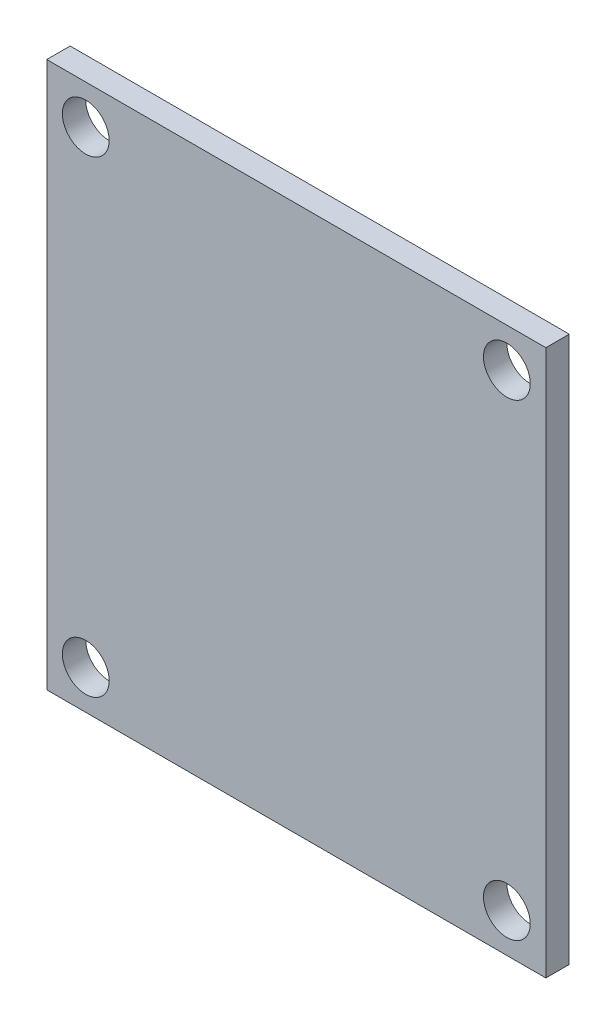
ISO-10303-21;
HEADER;
FILE_DESCRIPTION(('STEP AP214'),'2;1');
FILE_NAME('part.step','',(''),(''),'','','');
FILE_SCHEMA(('AUTOMOTIVE_DESIGN { 1 0 10303 214 1 1 1 1 }'));
ENDSEC;
DATA;
#1=APPLICATION_CONTEXT('core data for automotive mechanical design processes');
#2=APPLICATION_PROTOCOL_DEFINITION('international standard','automotive_design',2000,#1);
#3=PRODUCT_CONTEXT('',#1,'mechanical');
#4=PRODUCT('Part','Part','',(#3));
#5=PRODUCT_RELATED_PRODUCT_CATEGORY('part','',(#4));
#6=PRODUCT_DEFINITION_FORMATION('','',#4);
#7=PRODUCT_DEFINITION_CONTEXT('part definition',#1,'design');
#8=PRODUCT_DEFINITION('design','',#6,#7);
#9=PRODUCT_DEFINITION_SHAPE('','',#8);
#10=(LENGTH_UNIT() NAMED_UNIT(*) SI_UNIT(.MILLI.,.METRE.));
#11=(NAMED_UNIT(*) PLANE_ANGLE_UNIT() SI_UNIT($,.RADIAN.));
#12=(NAMED_UNIT(*) SI_UNIT($,.STERADIAN.) SOLID_ANGLE_UNIT());
#13=UNCERTAINTY_MEASURE_WITH_UNIT(LENGTH_MEASURE(1.E-05),#10,'distance_accuracy_value','');
#14=(GEOMETRIC_REPRESENTATION_CONTEXT(3) GLOBAL_UNCERTAINTY_ASSIGNED_CONTEXT((#13)) GLOBAL_UNIT_ASSIGNED_CONTEXT((#10,
#11,#12)) REPRESENTATION_CONTEXT('',''));
#15=CARTESIAN_POINT('',(0.,0.,0.));
#16=DIRECTION('',(0.,0.,1.));
#17=DIRECTION('',(1.,0.,0.));
#18=AXIS2_PLACEMENT_3D('',#15,#16,#17);
#19=CARTESIAN_POINT('',(0.,0.,1.5));
#20=DIRECTION('',(0.,0.,-1.));
#21=DIRECTION('',(-1.,0.,0.));
#22=AXIS2_PLACEMENT_3D('',#19,#20,#21);
#23=PLANE('',#22);
#24=DIRECTION('',(0.,-1.,0.));
#25=VECTOR('',#24,1.);
#26=CARTESIAN_POINT('',(0.,0.,1.5));
#27=LINE('',#26,#25);
#28=CARTESIAN_POINT('',(0.,35.,1.5));
#29=VERTEX_POINT('',#28);
#30=CARTESIAN_POINT('',(0.,0.,1.5));
#31=VERTEX_POINT('',#30);
#32=EDGE_CURVE('E98',#29,#31,#27,.T.);
#33=ORIENTED_EDGE('',*,*,#32,.T.);
#34=DIRECTION('',(1.,0.,0.));
#35=VECTOR('',#34,1.);
#36=CARTESIAN_POINT('',(0.,0.,1.5));
#37=LINE('',#36,#35);
#38=CARTESIAN_POINT('',(32.,0.,1.5));
#39=VERTEX_POINT('',#38);
#40=EDGE_CURVE('E93',#31,#39,#37,.T.);
#41=ORIENTED_EDGE('',*,*,#40,.T.);
#42=DIRECTION('',(0.,1.,0.));
#43=VECTOR('',#42,1.);
#44=CARTESIAN_POINT('',(32.,0.,1.5));
#45=LINE('',#44,#43);
#46=CARTESIAN_POINT('',(32.,35.,1.5));
#47=VERTEX_POINT('',#46);
#48=EDGE_CURVE('E96',#39,#47,#45,.T.);
#49=ORIENTED_EDGE('',*,*,#48,.T.);
#50=DIRECTION('',(-1.,0.,0.));
#51=VECTOR('',#50,1.);
#52=CARTESIAN_POINT('',(0.,35.,1.5));
#53=LINE('',#52,#51);
#54=EDGE_CURVE('E63',#47,#29,#53,.T.);
#55=ORIENTED_EDGE('',*,*,#54,.T.);
#56=EDGE_LOOP('',(#33,#41,#49,#55));
#57=FACE_BOUND('',#56,.T.);
#58=CARTESIAN_POINT('',(2.5,32.5,1.5));
#59=DIRECTION('',(0.,0.,1.));
#60=DIRECTION('',(1.,0.,0.));
#61=AXIS2_PLACEMENT_3D('',#58,#59,#60);
#62=CIRCLE('',#61,1.5);
#63=CARTESIAN_POINT('',(4.,32.5,1.5));
#64=VERTEX_POINT('',#63);
#65=EDGE_CURVE('E118',#64,#64,#62,.T.);
#66=ORIENTED_EDGE('',*,*,#65,.F.);
#67=EDGE_LOOP('',(#66));
#68=FACE_BOUND('',#67,.T.);
#69=CARTESIAN_POINT('',(29.5,32.5,1.5));
#70=DIRECTION('',(0.,0.,1.));
#71=DIRECTION('',(-1.,0.,0.));
#72=AXIS2_PLACEMENT_3D('',#69,#70,#71);
#73=CIRCLE('',#72,1.5);
#74=CARTESIAN_POINT('',(28.,32.5,1.5));
#75=VERTEX_POINT('',#74);
#76=EDGE_CURVE('E140',#75,#75,#73,.T.);
#77=ORIENTED_EDGE('',*,*,#76,.F.);
#78=EDGE_LOOP('',(#77));
#79=FACE_BOUND('',#78,.T.);
#80=CARTESIAN_POINT('',(29.5,2.5,1.5));
#81=DIRECTION('',(0.,0.,1.));
#82=DIRECTION('',(1.,0.,0.));
#83=AXIS2_PLACEMENT_3D('',#80,#81,#82);
#84=CIRCLE('',#83,1.5);
#85=CARTESIAN_POINT('',(31.,2.5,1.5));
#86=VERTEX_POINT('',#85);
#87=EDGE_CURVE('E148',#86,#86,#84,.T.);
#88=ORIENTED_EDGE('',*,*,#87,.F.);
#89=EDGE_LOOP('',(#88));
#90=FACE_BOUND('',#89,.T.);
#91=CARTESIAN_POINT('',(2.5,2.5,1.5));
#92=DIRECTION('',(0.,0.,1.));
#93=DIRECTION('',(-1.,0.,0.));
#94=AXIS2_PLACEMENT_3D('',#91,#92,#93);
#95=CIRCLE('',#94,1.5);
#96=CARTESIAN_POINT('',(1.,2.5,1.5));
#97=VERTEX_POINT('',#96);
#98=EDGE_CURVE('E156',#97,#97,#95,.T.);
#99=ORIENTED_EDGE('',*,*,#98,.F.);
#100=EDGE_LOOP('',(#99));
#101=FACE_BOUND('',#100,.T.);
#102=ADVANCED_FACE('F45',(#57,#68,#79,#90,#101),#23,.F.);
#103=CARTESIAN_POINT('',(0.,0.,0.));
#104=DIRECTION('',(0.,0.,-1.));
#105=DIRECTION('',(-1.,0.,0.));
#106=AXIS2_PLACEMENT_3D('',#103,#104,#105);
#107=PLANE('',#106);
#108=CARTESIAN_POINT('',(29.5,2.5,0.));
#109=DIRECTION('',(0.,0.,1.));
#110=DIRECTION('',(1.,0.,0.));
#111=AXIS2_PLACEMENT_3D('',#108,#109,#110);
#112=CIRCLE('',#111,1.5);
#113=CARTESIAN_POINT('',(31.,2.5,0.));
#114=VERTEX_POINT('',#113);
#115=EDGE_CURVE('E152',#114,#114,#112,.T.);
#116=ORIENTED_EDGE('',*,*,#115,.T.);
#117=EDGE_LOOP('',(#116));
#118=FACE_BOUND('',#117,.T.);
#119=CARTESIAN_POINT('',(2.5,32.5,0.));
#120=DIRECTION('',(0.,0.,1.));
#121=DIRECTION('',(1.,0.,0.));
#122=AXIS2_PLACEMENT_3D('',#119,#120,#121);
#123=CIRCLE('',#122,1.5);
#124=CARTESIAN_POINT('',(4.,32.5,0.));
#125=VERTEX_POINT('',#124);
#126=EDGE_CURVE('E136',#125,#125,#123,.T.);
#127=ORIENTED_EDGE('',*,*,#126,.T.);
#128=EDGE_LOOP('',(#127));
#129=FACE_BOUND('',#128,.T.);
#130=DIRECTION('',(0.,-1.,0.));
#131=VECTOR('',#130,1.);
#132=CARTESIAN_POINT('',(0.,0.,0.));
#133=LINE('',#132,#131);
#134=CARTESIAN_POINT('',(0.,35.,0.));
#135=VERTEX_POINT('',#134);
#136=CARTESIAN_POINT('',(0.,0.,0.));
#137=VERTEX_POINT('',#136);
#138=EDGE_CURVE('E114',#135,#137,#133,.T.);
#139=ORIENTED_EDGE('',*,*,#138,.F.);
#140=DIRECTION('',(-1.,0.,0.));
#141=VECTOR('',#140,1.);
#142=CARTESIAN_POINT('',(0.,35.,0.));
#143=LINE('',#142,#141);
#144=CARTESIAN_POINT('',(32.,35.,0.));
#145=VERTEX_POINT('',#144);
#146=EDGE_CURVE('E86',#145,#135,#143,.T.);
#147=ORIENTED_EDGE('',*,*,#146,.F.);
#148=DIRECTION('',(0.,1.,0.));
#149=VECTOR('',#148,1.);
#150=CARTESIAN_POINT('',(32.,0.,0.));
#151=LINE('',#150,#149);
#152=CARTESIAN_POINT('',(32.,0.,0.));
#153=VERTEX_POINT('',#152);
#154=EDGE_CURVE('E80',#153,#145,#151,.T.);
#155=ORIENTED_EDGE('',*,*,#154,.F.);
#156=DIRECTION('',(1.,0.,0.));
#157=VECTOR('',#156,1.);
#158=CARTESIAN_POINT('',(0.,0.,0.));
#159=LINE('',#158,#157);
#160=EDGE_CURVE('E103',#137,#153,#159,.T.);
#161=ORIENTED_EDGE('',*,*,#160,.F.);
#162=EDGE_LOOP('',(#139,#147,#155,#161));
#163=FACE_BOUND('',#162,.T.);
#164=CARTESIAN_POINT('',(29.5,32.5,0.));
#165=DIRECTION('',(0.,0.,1.));
#166=DIRECTION('',(-1.,0.,0.));
#167=AXIS2_PLACEMENT_3D('',#164,#165,#166);
#168=CIRCLE('',#167,1.5);
#169=CARTESIAN_POINT('',(28.,32.5,0.));
#170=VERTEX_POINT('',#169);
#171=EDGE_CURVE('E144',#170,#170,#168,.T.);
#172=ORIENTED_EDGE('',*,*,#171,.T.);
#173=EDGE_LOOP('',(#172));
#174=FACE_BOUND('',#173,.T.);
#175=CARTESIAN_POINT('',(2.5,2.5,0.));
#176=DIRECTION('',(0.,0.,1.));
#177=DIRECTION('',(-1.,0.,0.));
#178=AXIS2_PLACEMENT_3D('',#175,#176,#177);
#179=CIRCLE('',#178,1.5);
#180=CARTESIAN_POINT('',(1.,2.5,0.));
#181=VERTEX_POINT('',#180);
#182=EDGE_CURVE('E160',#181,#181,#179,.T.);
#183=ORIENTED_EDGE('',*,*,#182,.T.);
#184=EDGE_LOOP('',(#183));
#185=FACE_BOUND('',#184,.T.);
#186=ADVANCED_FACE('F131',(#118,#129,#163,#174,#185),#107,.T.);
#187=CARTESIAN_POINT('',(0.,0.,1.5));
#188=DIRECTION('',(1.,0.,0.));
#189=DIRECTION('',(0.,0.,-1.));
#190=AXIS2_PLACEMENT_3D('',#187,#188,#189);
#191=PLANE('',#190);
#192=ORIENTED_EDGE('',*,*,#138,.T.);
#193=DIRECTION('',(0.,0.,-1.));
#194=VECTOR('',#193,1.);
#195=CARTESIAN_POINT('',(0.,0.,1.5));
#196=LINE('',#195,#194);
#197=EDGE_CURVE('E11',#31,#137,#196,.T.);
#198=ORIENTED_EDGE('',*,*,#197,.F.);
#199=ORIENTED_EDGE('',*,*,#32,.F.);
#200=DIRECTION('',(0.,0.,-1.));
#201=VECTOR('',#200,1.);
#202=CARTESIAN_POINT('',(0.,35.,1.5));
#203=LINE('',#202,#201);
#204=EDGE_CURVE('E110',#29,#135,#203,.T.);
#205=ORIENTED_EDGE('',*,*,#204,.T.);
#206=EDGE_LOOP('',(#192,#198,#199,#205));
#207=FACE_BOUND('',#206,.T.);
#208=ADVANCED_FACE('F47',(#207),#191,.F.);
#209=CARTESIAN_POINT('',(0.,0.,1.5));
#210=DIRECTION('',(0.,1.,0.));
#211=DIRECTION('',(0.,0.,1.));
#212=AXIS2_PLACEMENT_3D('',#209,#210,#211);
#213=PLANE('',#212);
#214=ORIENTED_EDGE('',*,*,#160,.T.);
#215=DIRECTION('',(0.,0.,-1.));
#216=VECTOR('',#215,1.);
#217=CARTESIAN_POINT('',(32.,0.,1.5));
#218=LINE('',#217,#216);
#219=EDGE_CURVE('E55',#39,#153,#218,.T.);
#220=ORIENTED_EDGE('',*,*,#219,.F.);
#221=ORIENTED_EDGE('',*,*,#40,.F.);
#222=ORIENTED_EDGE('',*,*,#197,.T.);
#223=EDGE_LOOP('',(#214,#220,#221,#222));
#224=FACE_BOUND('',#223,.T.);
#225=ADVANCED_FACE('F102',(#224),#213,.F.);
#226=CARTESIAN_POINT('',(32.,0.,1.5));
#227=DIRECTION('',(-1.,0.,0.));
#228=DIRECTION('',(0.,0.,1.));
#229=AXIS2_PLACEMENT_3D('',#226,#227,#228);
#230=PLANE('',#229);
#231=ORIENTED_EDGE('',*,*,#154,.T.);
#232=DIRECTION('',(0.,0.,-1.));
#233=VECTOR('',#232,1.);
#234=CARTESIAN_POINT('',(32.,35.,1.5));
#235=LINE('',#234,#233);
#236=EDGE_CURVE('E105',#47,#145,#235,.T.);
#237=ORIENTED_EDGE('',*,*,#236,.F.);
#238=ORIENTED_EDGE('',*,*,#48,.F.);
#239=ORIENTED_EDGE('',*,*,#219,.T.);
#240=EDGE_LOOP('',(#231,#237,#238,#239));
#241=FACE_BOUND('',#240,.T.);
#242=ADVANCED_FACE('F106',(#241),#230,.F.);
#243=CARTESIAN_POINT('',(0.,35.,1.5));
#244=DIRECTION('',(0.,-1.,0.));
#245=DIRECTION('',(0.,0.,-1.));
#246=AXIS2_PLACEMENT_3D('',#243,#244,#245);
#247=PLANE('',#246);
#248=ORIENTED_EDGE('',*,*,#146,.T.);
#249=ORIENTED_EDGE('',*,*,#204,.F.);
#250=ORIENTED_EDGE('',*,*,#54,.F.);
#251=ORIENTED_EDGE('',*,*,#236,.T.);
#252=EDGE_LOOP('',(#248,#249,#250,#251));
#253=FACE_BOUND('',#252,.T.);
#254=ADVANCED_FACE('F128',(#253),#247,.F.);
#255=CARTESIAN_POINT('',(2.5,32.5,1.5));
#256=DIRECTION('',(0.,0.,-1.));
#257=DIRECTION('',(-1.,0.,0.));
#258=AXIS2_PLACEMENT_3D('',#255,#256,#257);
#259=CYLINDRICAL_SURFACE('',#258,1.5);
#260=ORIENTED_EDGE('',*,*,#65,.T.);
#261=EDGE_LOOP('',(#260));
#262=FACE_BOUND('',#261,.T.);
#263=ORIENTED_EDGE('',*,*,#126,.F.);
#264=EDGE_LOOP('',(#263));
#265=FACE_BOUND('',#264,.T.);
#266=ADVANCED_FACE('F179',(#262,#265),#259,.F.);
#267=CARTESIAN_POINT('',(29.5,32.5,1.5));
#268=DIRECTION('',(0.,0.,-1.));
#269=DIRECTION('',(-1.,0.,0.));
#270=AXIS2_PLACEMENT_3D('',#267,#268,#269);
#271=CYLINDRICAL_SURFACE('',#270,1.5);
#272=ORIENTED_EDGE('',*,*,#76,.T.);
#273=EDGE_LOOP('',(#272));
#274=FACE_BOUND('',#273,.T.);
#275=ORIENTED_EDGE('',*,*,#171,.F.);
#276=EDGE_LOOP('',(#275));
#277=FACE_BOUND('',#276,.T.);
#278=ADVANCED_FACE('F233',(#274,#277),#271,.F.);
#279=CARTESIAN_POINT('',(29.5,2.5,1.5));
#280=DIRECTION('',(0.,0.,-1.));
#281=DIRECTION('',(-1.,0.,0.));
#282=AXIS2_PLACEMENT_3D('',#279,#280,#281);
#283=CYLINDRICAL_SURFACE('',#282,1.5);
#284=ORIENTED_EDGE('',*,*,#87,.T.);
#285=EDGE_LOOP('',(#284));
#286=FACE_BOUND('',#285,.T.);
#287=ORIENTED_EDGE('',*,*,#115,.F.);
#288=EDGE_LOOP('',(#287));
#289=FACE_BOUND('',#288,.T.);
#290=ADVANCED_FACE('F242',(#286,#289),#283,.F.);
#291=CARTESIAN_POINT('',(2.5,2.5,1.5));
#292=DIRECTION('',(0.,0.,-1.));
#293=DIRECTION('',(-1.,0.,0.));
#294=AXIS2_PLACEMENT_3D('',#291,#292,#293);
#295=CYLINDRICAL_SURFACE('',#294,1.5);
#296=ORIENTED_EDGE('',*,*,#98,.T.);
#297=EDGE_LOOP('',(#296));
#298=FACE_BOUND('',#297,.T.);
#299=ORIENTED_EDGE('',*,*,#182,.F.);
#300=EDGE_LOOP('',(#299));
#301=FACE_BOUND('',#300,.T.);
#302=ADVANCED_FACE('F168',(#298,#301),#295,.F.);
#303=CLOSED_SHELL('',(#102,#186,#208,#225,#242,#254,#266,#278,#290,#302));
#304=MANIFOLD_SOLID_BREP('B2',#303);
#305=ADVANCED_BREP_SHAPE_REPRESENTATION('',(#18,#304),#14);
#306=SHAPE_DEFINITION_REPRESENTATION(#9,#305);
ENDSEC;
END-ISO-10303-21;
